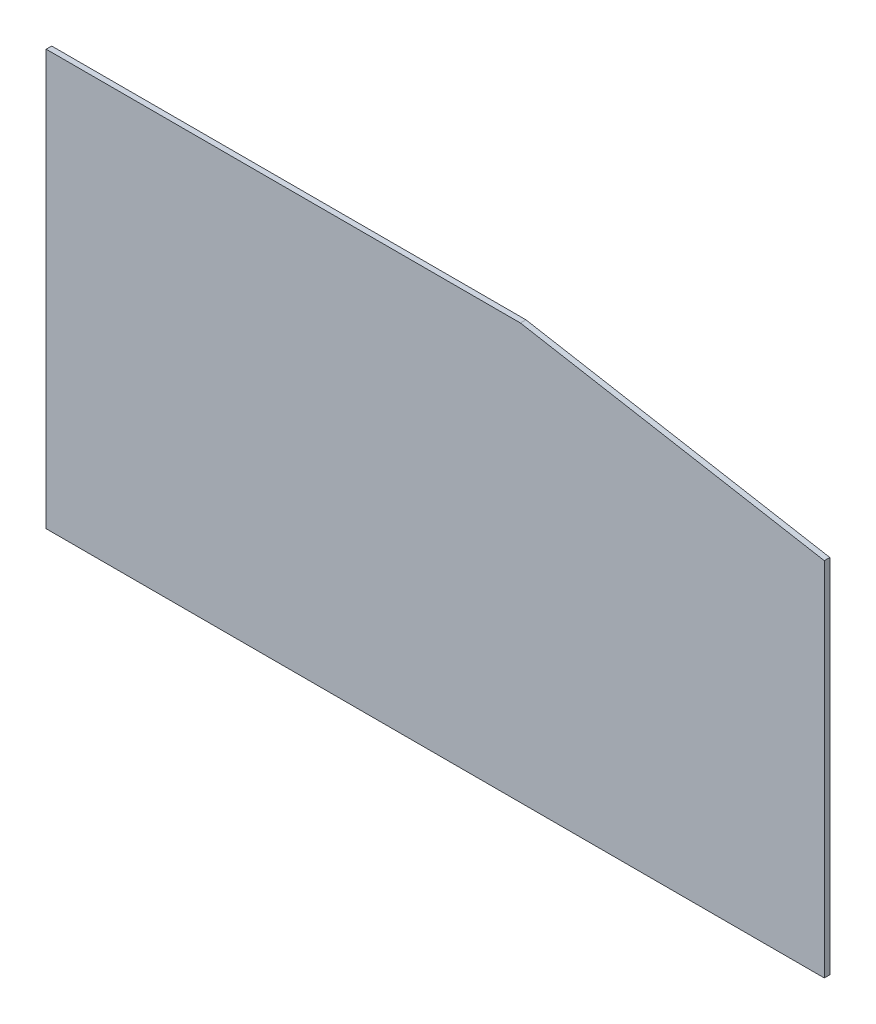
ISO-10303-21;
HEADER;
FILE_DESCRIPTION(('STEP AP214'),'2;1');
FILE_NAME('part.step','',(''),(''),'','','');
FILE_SCHEMA(('AUTOMOTIVE_DESIGN { 1 0 10303 214 1 1 1 1 }'));
ENDSEC;
DATA;
#1=APPLICATION_CONTEXT('core data for automotive mechanical design processes');
#2=APPLICATION_PROTOCOL_DEFINITION('international standard','automotive_design',2000,#1);
#3=PRODUCT_CONTEXT('',#1,'mechanical');
#4=PRODUCT('Part','Part','',(#3));
#5=PRODUCT_RELATED_PRODUCT_CATEGORY('part','',(#4));
#6=PRODUCT_DEFINITION_FORMATION('','',#4);
#7=PRODUCT_DEFINITION_CONTEXT('part definition',#1,'design');
#8=PRODUCT_DEFINITION('design','',#6,#7);
#9=PRODUCT_DEFINITION_SHAPE('','',#8);
#10=(LENGTH_UNIT() NAMED_UNIT(*) SI_UNIT(.MILLI.,.METRE.));
#11=(NAMED_UNIT(*) PLANE_ANGLE_UNIT() SI_UNIT($,.RADIAN.));
#12=(NAMED_UNIT(*) SI_UNIT($,.STERADIAN.) SOLID_ANGLE_UNIT());
#13=UNCERTAINTY_MEASURE_WITH_UNIT(LENGTH_MEASURE(1.E-05),#10,'distance_accuracy_value','');
#14=(GEOMETRIC_REPRESENTATION_CONTEXT(3) GLOBAL_UNCERTAINTY_ASSIGNED_CONTEXT((#13)) GLOBAL_UNIT_ASSIGNED_CONTEXT((#10,
#11,#12)) REPRESENTATION_CONTEXT('',''));
#15=CARTESIAN_POINT('',(0.,0.,0.));
#16=DIRECTION('',(0.,0.,1.));
#17=DIRECTION('',(1.,0.,0.));
#18=AXIS2_PLACEMENT_3D('',#15,#16,#17);
#19=CARTESIAN_POINT('',(660.,911.999999999999,-12.));
#20=DIRECTION('',(0.,1.,0.));
#21=DIRECTION('',(-1.,0.,0.));
#22=AXIS2_PLACEMENT_3D('',#19,#20,#21);
#23=PLANE('',#22);
#24=DIRECTION('',(0.,0.,1.));
#25=VECTOR('',#24,1.);
#26=CARTESIAN_POINT('',(810.,911.999999999999,-12.));
#27=LINE('',#26,#25);
#28=CARTESIAN_POINT('',(810.,911.999999999999,-12.));
#29=VERTEX_POINT('',#28);
#30=CARTESIAN_POINT('',(810.,911.999999999999,0.));
#31=VERTEX_POINT('',#30);
#32=EDGE_CURVE('E82',#29,#31,#27,.T.);
#33=ORIENTED_EDGE('',*,*,#32,.T.);
#34=DIRECTION('',(-1.,0.,0.));
#35=VECTOR('',#34,1.);
#36=CARTESIAN_POINT('',(660.,911.999999999999,0.));
#37=LINE('',#36,#35);
#38=CARTESIAN_POINT('',(1840.,911.999999999999,0.));
#39=VERTEX_POINT('',#38);
#40=EDGE_CURVE('E115',#39,#31,#37,.T.);
#41=ORIENTED_EDGE('',*,*,#40,.F.);
#42=DIRECTION('',(0.,0.,1.));
#43=VECTOR('',#42,1.);
#44=CARTESIAN_POINT('',(1840.,911.999999999999,-12.));
#45=LINE('',#44,#43);
#46=CARTESIAN_POINT('',(1840.,911.999999999999,-12.));
#47=VERTEX_POINT('',#46);
#48=EDGE_CURVE('E46',#47,#39,#45,.T.);
#49=ORIENTED_EDGE('',*,*,#48,.F.);
#50=DIRECTION('',(-1.,0.,0.));
#51=VECTOR('',#50,1.);
#52=CARTESIAN_POINT('',(660.,911.999999999999,-12.));
#53=LINE('',#52,#51);
#54=EDGE_CURVE('E96',#47,#29,#53,.T.);
#55=ORIENTED_EDGE('',*,*,#54,.T.);
#56=EDGE_LOOP('',(#33,#41,#49,#55));
#57=FACE_BOUND('',#56,.T.);
#58=ADVANCED_FACE('F38',(#57),#23,.T.);
#59=CARTESIAN_POINT('',(1840.,911.999999999999,-12.));
#60=DIRECTION('',(0.174551252246048,0.984648089593097,0.));
#61=DIRECTION('',(-0.984648089593098,0.174551252246048,0.));
#62=AXIS2_PLACEMENT_3D('',#59,#60,#61);
#63=PLANE('',#62);
#64=DIRECTION('',(-0.984648089593098,0.174551252246048,0.));
#65=VECTOR('',#64,1.);
#66=CARTESIAN_POINT('',(1840.,911.999999999999,0.));
#67=LINE('',#66,#65);
#68=CARTESIAN_POINT('',(2500.,795.,0.));
#69=VERTEX_POINT('',#68);
#70=EDGE_CURVE('E111',#69,#39,#67,.T.);
#71=ORIENTED_EDGE('',*,*,#70,.F.);
#72=DIRECTION('',(0.,0.,1.));
#73=VECTOR('',#72,1.);
#74=CARTESIAN_POINT('',(2500.,795.,-12.));
#75=LINE('',#74,#73);
#76=CARTESIAN_POINT('',(2500.,795.,-12.));
#77=VERTEX_POINT('',#76);
#78=EDGE_CURVE('E101',#77,#69,#75,.T.);
#79=ORIENTED_EDGE('',*,*,#78,.F.);
#80=DIRECTION('',(-0.984648089593098,0.174551252246048,0.));
#81=VECTOR('',#80,1.);
#82=CARTESIAN_POINT('',(1840.,911.999999999999,-12.));
#83=LINE('',#82,#81);
#84=EDGE_CURVE('E102',#77,#47,#83,.T.);
#85=ORIENTED_EDGE('',*,*,#84,.T.);
#86=ORIENTED_EDGE('',*,*,#48,.T.);
#87=EDGE_LOOP('',(#71,#79,#85,#86));
#88=FACE_BOUND('',#87,.T.);
#89=ADVANCED_FACE('F119',(#88),#63,.T.);
#90=CARTESIAN_POINT('',(2500.,795.,-12.));
#91=DIRECTION('',(1.,0.,0.));
#92=DIRECTION('',(0.,0.,-1.));
#93=AXIS2_PLACEMENT_3D('',#90,#91,#92);
#94=PLANE('',#93);
#95=DIRECTION('',(0.,0.,1.));
#96=VECTOR('',#95,1.);
#97=CARTESIAN_POINT('',(2500.,10.0000000000001,-12.));
#98=LINE('',#97,#96);
#99=CARTESIAN_POINT('',(2500.,10.0000000000001,-12.));
#100=VERTEX_POINT('',#99);
#101=CARTESIAN_POINT('',(2500.,10.,0.));
#102=VERTEX_POINT('',#101);
#103=EDGE_CURVE('E112',#100,#102,#98,.T.);
#104=ORIENTED_EDGE('',*,*,#103,.F.);
#105=DIRECTION('',(0.,1.,0.));
#106=VECTOR('',#105,1.);
#107=CARTESIAN_POINT('',(2500.,795.,-12.));
#108=LINE('',#107,#106);
#109=EDGE_CURVE('E105',#100,#77,#108,.T.);
#110=ORIENTED_EDGE('',*,*,#109,.T.);
#111=ORIENTED_EDGE('',*,*,#78,.T.);
#112=DIRECTION('',(0.,1.,0.));
#113=VECTOR('',#112,1.);
#114=CARTESIAN_POINT('',(2500.,795.,0.));
#115=LINE('',#114,#113);
#116=EDGE_CURVE('E109',#102,#69,#115,.T.);
#117=ORIENTED_EDGE('',*,*,#116,.F.);
#118=EDGE_LOOP('',(#104,#110,#111,#117));
#119=FACE_BOUND('',#118,.T.);
#120=ADVANCED_FACE('F40',(#119),#94,.T.);
#121=CARTESIAN_POINT('',(0.,0.,-12.));
#122=DIRECTION('',(0.,0.,-1.));
#123=DIRECTION('',(-1.,0.,0.));
#124=AXIS2_PLACEMENT_3D('',#121,#122,#123);
#125=PLANE('',#124);
#126=DIRECTION('',(0.,1.,0.));
#127=VECTOR('',#126,1.);
#128=CARTESIAN_POINT('',(810.,9.9999999999998,-12.));
#129=LINE('',#128,#127);
#130=CARTESIAN_POINT('',(810.,10.0000000000001,-12.));
#131=VERTEX_POINT('',#130);
#132=EDGE_CURVE('E53',#131,#29,#129,.T.);
#133=ORIENTED_EDGE('',*,*,#132,.T.);
#134=ORIENTED_EDGE('',*,*,#54,.F.);
#135=ORIENTED_EDGE('',*,*,#84,.F.);
#136=ORIENTED_EDGE('',*,*,#109,.F.);
#137=DIRECTION('',(-1.,0.,0.));
#138=VECTOR('',#137,1.);
#139=CARTESIAN_POINT('',(0.,10.0000000000001,-12.));
#140=LINE('',#139,#138);
#141=EDGE_CURVE('E99',#100,#131,#140,.T.);
#142=ORIENTED_EDGE('',*,*,#141,.T.);
#143=EDGE_LOOP('',(#133,#134,#135,#136,#142));
#144=FACE_BOUND('',#143,.T.);
#145=ADVANCED_FACE('F94',(#144),#125,.T.);
#146=CARTESIAN_POINT('',(0.,0.,0.));
#147=DIRECTION('',(0.,0.,-1.));
#148=DIRECTION('',(-1.,0.,0.));
#149=AXIS2_PLACEMENT_3D('',#146,#147,#148);
#150=PLANE('',#149);
#151=ORIENTED_EDGE('',*,*,#40,.T.);
#152=DIRECTION('',(0.,-1.,0.));
#153=VECTOR('',#152,1.);
#154=CARTESIAN_POINT('',(810.,0.,0.));
#155=LINE('',#154,#153);
#156=CARTESIAN_POINT('',(810.,9.9999999999998,0.));
#157=VERTEX_POINT('',#156);
#158=EDGE_CURVE('E84',#31,#157,#155,.T.);
#159=ORIENTED_EDGE('',*,*,#158,.T.);
#160=DIRECTION('',(1.,0.,0.));
#161=VECTOR('',#160,1.);
#162=CARTESIAN_POINT('',(0.,10.0000000000001,0.));
#163=LINE('',#162,#161);
#164=EDGE_CURVE('E11',#157,#102,#163,.T.);
#165=ORIENTED_EDGE('',*,*,#164,.T.);
#166=ORIENTED_EDGE('',*,*,#116,.T.);
#167=ORIENTED_EDGE('',*,*,#70,.T.);
#168=EDGE_LOOP('',(#151,#159,#165,#166,#167));
#169=FACE_BOUND('',#168,.T.);
#170=ADVANCED_FACE('F121',(#169),#150,.F.);
#171=CARTESIAN_POINT('',(0.,10.0000000000001,-12.));
#172=DIRECTION('',(0.,1.,0.));
#173=DIRECTION('',(0.,0.,1.));
#174=AXIS2_PLACEMENT_3D('',#171,#172,#173);
#175=PLANE('',#174);
#176=ORIENTED_EDGE('',*,*,#164,.F.);
#177=DIRECTION('',(0.,0.,1.));
#178=VECTOR('',#177,1.);
#179=CARTESIAN_POINT('',(810.,9.9999999999998,-12.));
#180=LINE('',#179,#178);
#181=EDGE_CURVE('E89',#131,#157,#180,.T.);
#182=ORIENTED_EDGE('',*,*,#181,.F.);
#183=ORIENTED_EDGE('',*,*,#141,.F.);
#184=ORIENTED_EDGE('',*,*,#103,.T.);
#185=EDGE_LOOP('',(#176,#182,#183,#184));
#186=FACE_BOUND('',#185,.T.);
#187=ADVANCED_FACE('F130',(#186),#175,.F.);
#188=CARTESIAN_POINT('',(810.,9.9999999999998,-12.));
#189=DIRECTION('',(1.,0.,0.));
#190=DIRECTION('',(0.,0.,-1.));
#191=AXIS2_PLACEMENT_3D('',#188,#189,#190);
#192=PLANE('',#191);
#193=ORIENTED_EDGE('',*,*,#32,.F.);
#194=ORIENTED_EDGE('',*,*,#132,.F.);
#195=ORIENTED_EDGE('',*,*,#181,.T.);
#196=ORIENTED_EDGE('',*,*,#158,.F.);
#197=EDGE_LOOP('',(#193,#194,#195,#196));
#198=FACE_BOUND('',#197,.T.);
#199=ADVANCED_FACE('F83',(#198),#192,.F.);
#200=CLOSED_SHELL('',(#58,#89,#120,#145,#170,#187,#199));
#201=MANIFOLD_SOLID_BREP('B2',#200);
#202=ADVANCED_BREP_SHAPE_REPRESENTATION('',(#18,#201),#14);
#203=SHAPE_DEFINITION_REPRESENTATION(#9,#202);
ENDSEC;
END-ISO-10303-21;
